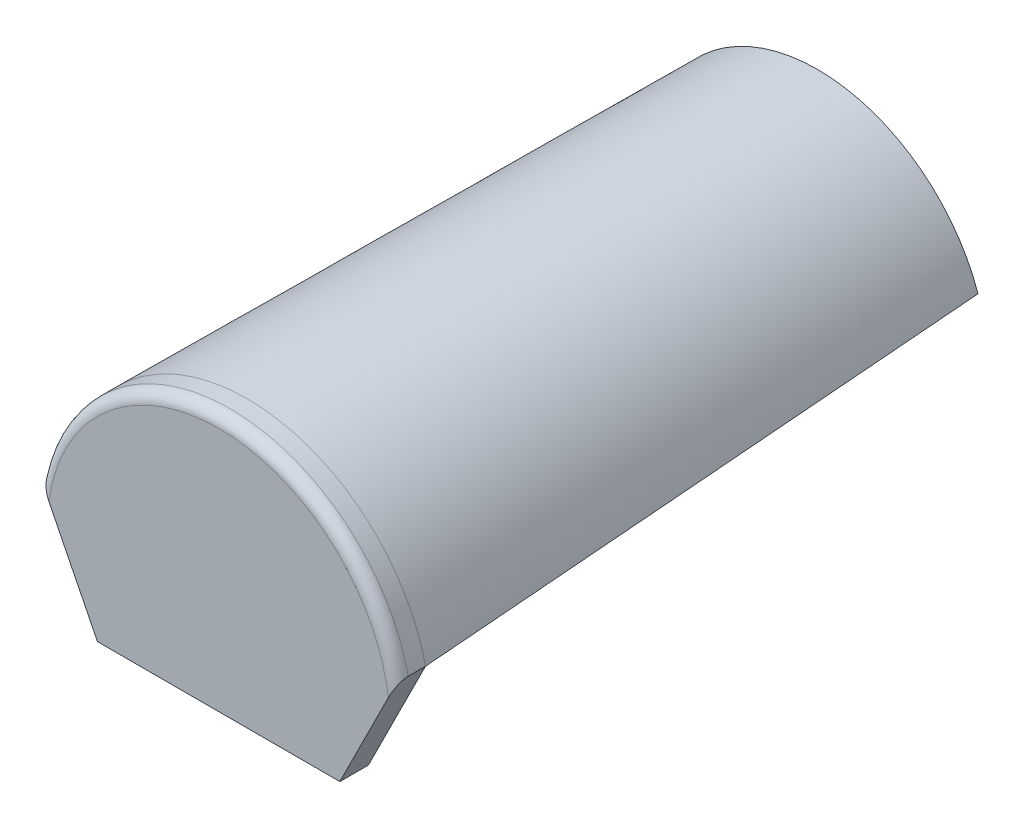
ISO-10303-21;
HEADER;
FILE_DESCRIPTION(('STEP AP214'),'2;1');
FILE_NAME('part.step','',(''),(''),'','','');
FILE_SCHEMA(('AUTOMOTIVE_DESIGN { 1 0 10303 214 1 1 1 1 }'));
ENDSEC;
DATA;
#1=APPLICATION_CONTEXT('core data for automotive mechanical design processes');
#2=APPLICATION_PROTOCOL_DEFINITION('international standard','automotive_design',2000,#1);
#3=PRODUCT_CONTEXT('',#1,'mechanical');
#4=PRODUCT('Part','Part','',(#3));
#5=PRODUCT_RELATED_PRODUCT_CATEGORY('part','',(#4));
#6=PRODUCT_DEFINITION_FORMATION('','',#4);
#7=PRODUCT_DEFINITION_CONTEXT('part definition',#1,'design');
#8=PRODUCT_DEFINITION('design','',#6,#7);
#9=PRODUCT_DEFINITION_SHAPE('','',#8);
#10=(LENGTH_UNIT() NAMED_UNIT(*) SI_UNIT(.MILLI.,.METRE.));
#11=(NAMED_UNIT(*) PLANE_ANGLE_UNIT() SI_UNIT($,.RADIAN.));
#12=(NAMED_UNIT(*) SI_UNIT($,.STERADIAN.) SOLID_ANGLE_UNIT());
#13=UNCERTAINTY_MEASURE_WITH_UNIT(LENGTH_MEASURE(1.E-05),#10,'distance_accuracy_value','');
#14=(GEOMETRIC_REPRESENTATION_CONTEXT(3) GLOBAL_UNCERTAINTY_ASSIGNED_CONTEXT((#13)) GLOBAL_UNIT_ASSIGNED_CONTEXT((#10,
#11,#12)) REPRESENTATION_CONTEXT('',''));
#15=CARTESIAN_POINT('',(0.,0.,0.));
#16=DIRECTION('',(0.,0.,1.));
#17=DIRECTION('',(1.,0.,0.));
#18=AXIS2_PLACEMENT_3D('',#15,#16,#17);
#19=CARTESIAN_POINT('',(125.,-28.125,20.));
#20=DIRECTION('',(0.,0.,-1.));
#21=DIRECTION('',(-1.,0.,0.));
#22=AXIS2_PLACEMENT_3D('',#19,#20,#21);
#23=CYLINDRICAL_SURFACE('',#22,128.125);
#24=DIRECTION('',(0.,0.,-1.));
#25=VECTOR('',#24,1.);
#26=CARTESIAN_POINT('',(0.,0.,20.));
#27=LINE('',#26,#25);
#28=CARTESIAN_POINT('',(0.,0.,12.));
#29=VERTEX_POINT('',#28);
#30=CARTESIAN_POINT('',(0.,0.,0.));
#31=VERTEX_POINT('',#30);
#32=EDGE_CURVE('E186',#29,#31,#27,.T.);
#33=ORIENTED_EDGE('',*,*,#32,.F.);
#34=CARTESIAN_POINT('',(125.,-28.125,12.));
#35=DIRECTION('',(0.,0.,1.));
#36=DIRECTION('',(1.,0.,0.));
#37=AXIS2_PLACEMENT_3D('',#34,#35,#36);
#38=CIRCLE('',#37,128.125);
#39=CARTESIAN_POINT('',(250.,0.,12.));
#40=VERTEX_POINT('',#39);
#41=EDGE_CURVE('E199',#29,#40,#38,.F.);
#42=ORIENTED_EDGE('',*,*,#41,.T.);
#43=DIRECTION('',(0.,0.,-1.));
#44=VECTOR('',#43,1.);
#45=CARTESIAN_POINT('',(250.,0.,20.));
#46=LINE('',#45,#44);
#47=CARTESIAN_POINT('',(250.,0.,0.));
#48=VERTEX_POINT('',#47);
#49=EDGE_CURVE('E238',#40,#48,#46,.T.);
#50=ORIENTED_EDGE('',*,*,#49,.T.);
#51=CARTESIAN_POINT('',(0.,0.,0.));
#52=CARTESIAN_POINT('',(1.60623277237835,7.13881232168169,0.));
#53=CARTESIAN_POINT('',(6.030879886365,21.0831731477727,0.));
#54=CARTESIAN_POINT('',(16.0473437789444,40.4505164377242,0.));
#55=CARTESIAN_POINT('',(29.1160998191318,57.7720338535226,0.));
#56=CARTESIAN_POINT('',(44.8500876651793,72.6082314918511,0.));
#57=CARTESIAN_POINT('',(62.8084470244667,84.5828128238449,0.));
#58=CARTESIAN_POINT('',(82.5049519033735,93.3866006304086,0.));
#59=CARTESIAN_POINT('',(103.415398608992,98.7826951482014,0.));
#60=CARTESIAN_POINT('',(117.79573479048,100.,0.));
#61=CARTESIAN_POINT('',(132.20426520952,100.,0.));
#62=CARTESIAN_POINT('',(146.584601391007,98.7826951482015,0.));
#63=CARTESIAN_POINT('',(167.495048096627,93.3866006304082,0.));
#64=CARTESIAN_POINT('',(187.191552975533,84.5828128238452,0.));
#65=CARTESIAN_POINT('',(205.149912334821,72.6082314918509,0.));
#66=CARTESIAN_POINT('',(220.883900180868,57.7720338535227,0.));
#67=CARTESIAN_POINT('',(233.952656221055,40.4505164377242,0.));
#68=CARTESIAN_POINT('',(243.969120113636,21.0831731477728,0.));
#69=CARTESIAN_POINT('',(248.393767227622,7.13881232168172,0.));
#70=CARTESIAN_POINT('',(250.,0.,0.));
#71=B_SPLINE_CURVE_WITH_KNOTS('',3,(#51,#52,#53,#54,#55,#56,#57,#58,#59,#60,#61,#62,#63,#64,#65,
#66,#67,#68,#69,#70),.UNSPECIFIED.,.F.,.F.,(4,1,1,1,1,1,1,1,2,1,1,1,1,1,1,1,4),
(0.472541137445926,0.505507316355555,0.538473495265185,0.571439674174815,0.604405853084444,
0.637372031994074,0.670338210903704,0.703304389813333,0.736270568722963,0.769236747632593,
0.802202926542222,0.835169105451852,0.868135284361481,0.901101463271111,0.934067642180741,
0.96703382109037,1.),.UNSPECIFIED.);
#72=EDGE_CURVE('E209',#31,#48,#71,.T.);
#73=ORIENTED_EDGE('',*,*,#72,.F.);
#74=EDGE_LOOP('',(#33,#42,#50,#73));
#75=FACE_BOUND('',#74,.T.);
#76=ADVANCED_FACE('F117',(#75),#23,.T.);
#77=CARTESIAN_POINT('',(116.90186054998,-233.803721099959,20.));
#78=DIRECTION('',(0.894427190999916,0.447213595499958,0.));
#79=DIRECTION('',(-0.447213595499958,0.894427190999916,0.));
#80=AXIS2_PLACEMENT_3D('',#77,#78,#79);
#81=PLANE('',#80);
#82=DIRECTION('',(0.447213595499958,-0.894427190999916,0.));
#83=VECTOR('',#82,1.);
#84=CARTESIAN_POINT('',(116.90186054998,-233.803721099959,20.));
#85=LINE('',#84,#83);
#86=CARTESIAN_POINT('',(5.97026255067591,-11.9405251013519,20.));
#87=VERTEX_POINT('',#86);
#88=CARTESIAN_POINT('',(40.,-80.,20.));
#89=VERTEX_POINT('',#88);
#90=EDGE_CURVE('E300',#87,#89,#85,.T.);
#91=ORIENTED_EDGE('',*,*,#90,.F.);
#92=CARTESIAN_POINT('',(5.9702625506759,-11.9405251013518,20.));
#93=CARTESIAN_POINT('',(5.82595946109599,-11.651918922192,19.9999817795034));
#94=CARTESIAN_POINT('',(5.68164689250519,-11.3632937850104,19.9937967903413));
#95=CARTESIAN_POINT('',(5.39321032370489,-10.7864206474098,19.9685980804405));
#96=CARTESIAN_POINT('',(5.24908638146081,-10.4981727629216,19.9495810645104));
#97=CARTESIAN_POINT('',(4.96056207165153,-9.92112414330308,19.8980893113744));
#98=CARTESIAN_POINT('',(4.81616415267594,-9.6323283053519,19.8655452288795));
#99=CARTESIAN_POINT('',(4.52815016631784,-9.05630033263571,19.7863583983228));
#100=CARTESIAN_POINT('',(4.38453403980707,-8.76906807961413,19.7397167320008));
#101=CARTESIAN_POINT('',(4.09672018392652,-8.19344036785304,19.6309397850744));
#102=CARTESIAN_POINT('',(3.95253576494703,-7.90507152989407,19.5686272740713));
#103=CARTESIAN_POINT('',(3.66575167923147,-7.33150335846298,19.4278795743591));
#104=CARTESIAN_POINT('',(3.52315188948474,-7.04630377896949,19.3494456464607));
#105=CARTESIAN_POINT('',(3.24035701906228,-6.48071403812456,19.1755617639944));
#106=CARTESIAN_POINT('',(3.10015748320891,-6.20031496641781,19.0801482175577));
#107=CARTESIAN_POINT('',(2.82254991417251,-5.64509982834499,18.8709843401185));
#108=CARTESIAN_POINT('',(2.6851409693012,-5.37028193860237,18.7572401099189));
#109=CARTESIAN_POINT('',(2.44253242235396,-4.8850648447079,18.5360728408015));
#110=CARTESIAN_POINT('',(2.33665278874327,-4.67330557748652,18.4323777025299));
#111=CARTESIAN_POINT('',(2.12764032282034,-4.25528064564068,18.2119014321062));
#112=CARTESIAN_POINT('',(2.02450748027537,-4.04901496055075,18.0951203487122));
#113=CARTESIAN_POINT('',(1.8216681005836,-3.6433362011672,17.8476998645153));
#114=CARTESIAN_POINT('',(1.72196001470965,-3.44392002941928,17.7170668399828));
#115=CARTESIAN_POINT('',(1.52670017038173,-3.05340034076344,17.4410306427511));
#116=CARTESIAN_POINT('',(1.43114837663157,-2.86229675326313,17.2956275955173));
#117=CARTESIAN_POINT('',(1.2438214254033,-2.4876428508066,16.9869741326968));
#118=CARTESIAN_POINT('',(1.1521208365485,-2.304241673097,16.8234960897245));
#119=CARTESIAN_POINT('',(0.975222793028402,-1.95044558605679,16.479610359815));
#120=CARTESIAN_POINT('',(0.89002673982682,-1.78005347965362,16.2991990430066));
#121=CARTESIAN_POINT('',(0.727943683597129,-1.45588736719424,15.9215020576505));
#122=CARTESIAN_POINT('',(0.651033177350553,-1.30206635470108,15.7242671252149));
#123=CARTESIAN_POINT('',(0.507121742305845,-1.01424348461166,15.3125296992894));
#124=CARTESIAN_POINT('',(0.440112345019628,-0.880224690039225,15.0980422074217));
#125=CARTESIAN_POINT('',(0.342760607640115,-0.685521215280205,14.7427541016825));
#126=CARTESIAN_POINT('',(0.308545868378507,-0.617091736756991,14.6072150621359));
#127=CARTESIAN_POINT('',(0.244837165192571,-0.489674330385125,14.3307167598522));
#128=CARTESIAN_POINT('',(0.215341721730412,-0.43068344346081,14.1897592131175));
#129=CARTESIAN_POINT('',(0.161579498036405,-0.323158996072802,13.9032229119672));
#130=CARTESIAN_POINT('',(0.137303350913972,-0.274606701827939,13.7576529833679));
#131=CARTESIAN_POINT('',(0.0943500900458207,-0.188700180091644,13.4624883669084));
#132=CARTESIAN_POINT('',(0.0756714313704474,-0.151342862740901,13.3128948020331));
#133=CARTESIAN_POINT('',(0.0402371691266908,-0.0804743382533814,12.9716456326696));
#134=CARTESIAN_POINT('',(0.0252105392535766,-0.0504210785071384,12.7790637388159));
#135=CARTESIAN_POINT('',(0.0101182157460026,-0.0202364314920093,12.4881699163889));
#136=CARTESIAN_POINT('',(0.00632865577995934,-0.0126573115599358,12.3907556570888));
#137=CARTESIAN_POINT('',(0.00126834763367377,-0.00253669526736834,12.1955694053455));
#138=CARTESIAN_POINT('',(-1.5888051430922E-06,3.17761027482905E-06,12.0977973077785));
#139=CARTESIAN_POINT('',(0.,0.,12.));
#140=B_SPLINE_CURVE_WITH_KNOTS('',3,(#92,#93,#94,#95,#96,#97,#98,#99,#100,#101,#102,#103,#104,
#105,#106,#107,#108,#109,#110,#111,#112,#113,#114,#115,#116,#117,#118,#119,#120,#121,#122,#123,
#124,#125,#126,#127,#128,#129,#130,#131,#132,#133,#134,#135,#136,#137,#138,#139),.UNSPECIFIED.,
.F.,.F.,(4,2,2,2,2,2,2,2,2,2,2,2,2,2,2,2,2,2,2,2,2,2,2,4),(0.,0.96798730233927,1.93622327295291,
2.90948526153058,3.88267258843746,4.86740440165289,5.85205923104535,6.83462763420168,
7.81686969256157,8.59191371058613,9.36695484090341,10.141640743515,10.9163200660299,
11.7021988095809,12.4882464030713,13.2720020372362,14.0550833902919,14.5216169500379,
14.9880039598896,15.4535468420195,15.9189611138195,16.5040289226431,16.797235759781,
17.0905370433752),.UNSPECIFIED.);
#141=EDGE_CURVE('E13',#87,#29,#140,.T.);
#142=ORIENTED_EDGE('',*,*,#141,.T.);
#143=ORIENTED_EDGE('',*,*,#32,.T.);
#144=DIRECTION('',(0.447213595499958,-0.894427190999916,0.));
#145=VECTOR('',#144,1.);
#146=CARTESIAN_POINT('',(116.90186054998,-233.803721099959,0.));
#147=LINE('',#146,#145);
#148=CARTESIAN_POINT('',(40.,-80.,0.));
#149=VERTEX_POINT('',#148);
#150=EDGE_CURVE('E191',#31,#149,#147,.T.);
#151=ORIENTED_EDGE('',*,*,#150,.T.);
#152=DIRECTION('',(0.,0.,-1.));
#153=VECTOR('',#152,1.);
#154=CARTESIAN_POINT('',(40.,-80.,20.));
#155=LINE('',#154,#153);
#156=EDGE_CURVE('E200',#89,#149,#155,.T.);
#157=ORIENTED_EDGE('',*,*,#156,.F.);
#158=EDGE_LOOP('',(#91,#142,#143,#151,#157));
#159=FACE_BOUND('',#158,.T.);
#160=ADVANCED_FACE('F188',(#159),#81,.F.);
#161=CARTESIAN_POINT('',(125.,-80.,20.));
#162=DIRECTION('',(0.,1.,0.));
#163=DIRECTION('',(-1.,0.,0.));
#164=AXIS2_PLACEMENT_3D('',#161,#162,#163);
#165=PLANE('',#164);
#166=DIRECTION('',(1.,0.,0.));
#167=VECTOR('',#166,1.);
#168=CARTESIAN_POINT('',(125.,-80.,0.));
#169=LINE('',#168,#167);
#170=CARTESIAN_POINT('',(210.,-80.,0.));
#171=VERTEX_POINT('',#170);
#172=EDGE_CURVE('E234',#149,#171,#169,.T.);
#173=ORIENTED_EDGE('',*,*,#172,.T.);
#174=DIRECTION('',(0.,0.,-1.));
#175=VECTOR('',#174,1.);
#176=CARTESIAN_POINT('',(210.,-80.,20.));
#177=LINE('',#176,#175);
#178=CARTESIAN_POINT('',(210.,-80.,20.));
#179=VERTEX_POINT('',#178);
#180=EDGE_CURVE('E287',#179,#171,#177,.T.);
#181=ORIENTED_EDGE('',*,*,#180,.F.);
#182=DIRECTION('',(1.,0.,0.));
#183=VECTOR('',#182,1.);
#184=CARTESIAN_POINT('',(125.,-80.,20.));
#185=LINE('',#184,#183);
#186=EDGE_CURVE('E296',#89,#179,#185,.T.);
#187=ORIENTED_EDGE('',*,*,#186,.F.);
#188=ORIENTED_EDGE('',*,*,#156,.T.);
#189=EDGE_LOOP('',(#173,#181,#187,#188));
#190=FACE_BOUND('',#189,.T.);
#191=ADVANCED_FACE('F258',(#190),#165,.F.);
#192=CARTESIAN_POINT('',(133.09813945002,-233.803721099959,20.));
#193=DIRECTION('',(-0.894427190999916,0.447213595499958,0.));
#194=DIRECTION('',(-0.447213595499958,-0.894427190999916,0.));
#195=AXIS2_PLACEMENT_3D('',#192,#193,#194);
#196=PLANE('',#195);
#197=ORIENTED_EDGE('',*,*,#49,.F.);
#198=CARTESIAN_POINT('',(250.,0.,12.));
#199=CARTESIAN_POINT('',(250.000001001473,2.00294690712535E-06,12.0838213230434));
#200=CARTESIAN_POINT('',(249.999068437598,-0.00186312480393064,12.1676284210833));
#201=CARTESIAN_POINT('',(249.995348520284,-0.0093029594314035,12.3350310795616));
#202=CARTESIAN_POINT('',(249.992561290855,-0.0148774182894118,12.4186266537681));
#203=CARTESIAN_POINT('',(249.98144544465,-0.0371091107007333,12.6686242278631));
#204=CARTESIAN_POINT('',(249.970362603427,-0.0592747931459309,12.83445314013));
#205=CARTESIAN_POINT('',(249.94127870324,-0.117442593519188,13.161235877582));
#206=CARTESIAN_POINT('',(249.923349594707,-0.153300810586656,13.3222222240009));
#207=CARTESIAN_POINT('',(249.880979923896,-0.238040152208329,13.6398710574306));
#208=CARTESIAN_POINT('',(249.856538125399,-0.286923749201584,13.7965327173051));
#209=CARTESIAN_POINT('',(249.801769840534,-0.39646031893193,14.1038426888789));
#210=CARTESIAN_POINT('',(249.771468387462,-0.457063225075571,14.254513405487));
#211=CARTESIAN_POINT('',(249.70546289714,-0.589074205720376,14.5498487732153));
#212=CARTESIAN_POINT('',(249.66975666486,-0.66048667028031,14.6945109535443));
#213=CARTESIAN_POINT('',(249.555224413801,-0.889551172398159,15.1192452622234));
#214=CARTESIAN_POINT('',(249.469083696962,-1.06183260607521,15.3895279729615));
#215=CARTESIAN_POINT('',(249.236331569423,-1.5273368611538,16.0259714175674));
#216=CARTESIAN_POINT('',(249.080606676542,-1.83878664691653,16.3754004686895));
#217=CARTESIAN_POINT('',(248.830389848284,-2.33922030343266,16.8548583971933));
#218=CARTESIAN_POINT('',(248.744095746035,-2.51180850792966,17.0073907708141));
#219=CARTESIAN_POINT('',(248.566854516747,-2.86629096650621,17.2983725080864));
#220=CARTESIAN_POINT('',(248.475907472064,-3.0481850558711,17.436822120874));
#221=CARTESIAN_POINT('',(248.23857957924,-3.52284084152062,17.7736134472089));
#222=CARTESIAN_POINT('',(248.089498921358,-3.82100215728351,17.9624422794156));
#223=CARTESIAN_POINT('',(247.784562532253,-4.43087493549344,18.3105085483479));
#224=CARTESIAN_POINT('',(247.628702926174,-4.7425941476518,18.4697287790236));
#225=CARTESIAN_POINT('',(247.311430472489,-5.37713905502178,18.7616092213028));
#226=CARTESIAN_POINT('',(247.149998825979,-5.70000234804274,18.8941665411566));
#227=CARTESIAN_POINT('',(246.82351817758,-6.35296364484071,19.13420822846));
#228=CARTESIAN_POINT('',(246.658469838692,-6.68306032261508,19.2416971499995));
#229=CARTESIAN_POINT('',(246.290056916612,-7.4198861667756,19.4541579884725));
#230=CARTESIAN_POINT('',(246.086061527967,-7.82787694406689,19.5536532309992));
#231=CARTESIAN_POINT('',(245.675477315548,-8.64904536890418,19.7214892789746));
#232=CARTESIAN_POINT('',(245.468887423934,-9.06222515213241,19.7898167938281));
#233=CARTESIAN_POINT('',(245.057054471684,-9.88589105663204,19.896793990089));
#234=CARTESIAN_POINT('',(244.851831791093,-10.2963364178141,19.9358377991267));
#235=CARTESIAN_POINT('',(244.543644681936,-10.9127106361288,19.9745338747029));
#236=CARTESIAN_POINT('',(244.440907868982,-11.1181842620369,19.984121122954));
#237=CARTESIAN_POINT('',(244.235361347802,-11.5292773043968,19.99685191086));
#238=CARTESIAN_POINT('',(244.132551645244,-11.7348967095117,19.9999959061294));
#239=CARTESIAN_POINT('',(244.029737449324,-11.9405251013518,20.));
#240=B_SPLINE_CURVE_WITH_KNOTS('',3,(#198,#199,#200,#201,#202,#203,#204,#205,#206,#207,#208,
#209,#210,#211,#212,#213,#214,#215,#216,#217,#218,#219,#220,#221,#222,#223,#224,#225,#226,#227,
#228,#229,#230,#231,#232,#233,#234,#235,#236,#237,#238,#239),.UNSPECIFIED.,.F.,.F.,(4,2,2,2,2,2,
2,2,2,2,2,2,2,2,2,2,2,2,2,2,4),(0.,0.251410052657297,0.502803296863297,1.00494447028012,
1.50194752990346,1.9990449964642,2.49406392254795,2.98928443151722,3.98144821340837,
5.45274772937897,6.19022159830809,6.9276824184224,8.07527437152833,9.22353113950089,
10.3761374112834,11.5285341296516,12.9279109625886,14.3278839636079,15.7086589212987,
16.3983621964917,17.0880166997798),.UNSPECIFIED.);
#241=CARTESIAN_POINT('',(244.029737449324,-11.9405251013518,20.));
#242=VERTEX_POINT('',#241);
#243=EDGE_CURVE('E145',#40,#242,#240,.T.);
#244=ORIENTED_EDGE('',*,*,#243,.T.);
#245=DIRECTION('',(0.447213595499958,0.894427190999916,0.));
#246=VECTOR('',#245,1.);
#247=CARTESIAN_POINT('',(133.09813945002,-233.803721099959,20.));
#248=LINE('',#247,#246);
#249=EDGE_CURVE('E293',#179,#242,#248,.T.);
#250=ORIENTED_EDGE('',*,*,#249,.F.);
#251=ORIENTED_EDGE('',*,*,#180,.T.);
#252=DIRECTION('',(0.447213595499958,0.894427190999916,0.));
#253=VECTOR('',#252,1.);
#254=CARTESIAN_POINT('',(133.09813945002,-233.803721099959,0.));
#255=LINE('',#254,#253);
#256=EDGE_CURVE('E304',#171,#48,#255,.T.);
#257=ORIENTED_EDGE('',*,*,#256,.T.);
#258=EDGE_LOOP('',(#197,#244,#250,#251,#257));
#259=FACE_BOUND('',#258,.T.);
#260=ADVANCED_FACE('F261',(#259),#196,.F.);
#261=CARTESIAN_POINT('',(125.,-229.754651374949,20.));
#262=DIRECTION('',(0.,0.,1.));
#263=DIRECTION('',(1.,0.,0.));
#264=AXIS2_PLACEMENT_3D('',#261,#262,#263);
#265=PLANE('',#264);
#266=ORIENTED_EDGE('',*,*,#249,.T.);
#267=CARTESIAN_POINT('',(125.,-28.125,20.));
#268=DIRECTION('',(0.,0.,1.));
#269=DIRECTION('',(1.,0.,0.));
#270=AXIS2_PLACEMENT_3D('',#267,#268,#269);
#271=CIRCLE('',#270,120.125);
#272=EDGE_CURVE('E131',#242,#87,#271,.T.);
#273=ORIENTED_EDGE('',*,*,#272,.T.);
#274=ORIENTED_EDGE('',*,*,#90,.T.);
#275=ORIENTED_EDGE('',*,*,#186,.T.);
#276=EDGE_LOOP('',(#266,#273,#274,#275));
#277=FACE_BOUND('',#276,.T.);
#278=ADVANCED_FACE('F266',(#277),#265,.T.);
#279=CARTESIAN_POINT('',(125.,-229.754651374949,0.));
#280=DIRECTION('',(0.,0.,1.));
#281=DIRECTION('',(1.,0.,0.));
#282=AXIS2_PLACEMENT_3D('',#279,#280,#281);
#283=PLANE('',#282);
#284=ORIENTED_EDGE('',*,*,#150,.F.);
#285=DIRECTION('',(-1.,0.,0.));
#286=VECTOR('',#285,1.);
#287=CARTESIAN_POINT('',(0.,0.,0.));
#288=LINE('',#287,#286);
#289=CARTESIAN_POINT('',(20.,0.,0.));
#290=VERTEX_POINT('',#289);
#291=EDGE_CURVE('E223',#290,#31,#288,.T.);
#292=ORIENTED_EDGE('',*,*,#291,.F.);
#293=CARTESIAN_POINT('',(230.,0.,0.));
#294=CARTESIAN_POINT('',(229.493757838214,1.47654547475234,0.));
#295=CARTESIAN_POINT('',(228.956312640864,2.94238689454324,0.));
#296=CARTESIAN_POINT('',(227.820140072926,5.85005639712402,0.));
#297=CARTESIAN_POINT('',(227.221415191567,7.29188545255088,0.));
#298=CARTESIAN_POINT('',(225.963781400808,10.149010022975,0.));
#299=CARTESIAN_POINT('',(225.304873978876,11.564306192716,0.));
#300=CARTESIAN_POINT('',(223.927934449459,14.365828835031,0.));
#301=CARTESIAN_POINT('',(223.209902765419,15.7520555157103,0.));
#302=CARTESIAN_POINT('',(221.716449277304,18.4919917988752,0.));
#303=CARTESIAN_POINT('',(220.94106767989,19.8457233173696,0.));
#304=CARTESIAN_POINT('',(219.334006411574,22.5193289499796,0.));
#305=CARTESIAN_POINT('',(218.502327136566,23.8392033020934,0.));
#306=CARTESIAN_POINT('',(216.78414180656,26.4427696025431,0.));
#307=CARTESIAN_POINT('',(215.897636105421,27.726461784327,0.));
#308=CARTESIAN_POINT('',(214.071266852771,30.255269435823,0.));
#309=CARTESIAN_POINT('',(213.131403427182,31.500384996564,0.));
#310=CARTESIAN_POINT('',(210.877523922873,34.3588873344611,0.));
#311=CARTESIAN_POINT('',(209.543354489356,35.9564382979323,0.));
#312=CARTESIAN_POINT('',(206.787394393498,39.0742029001996,0.));
#313=CARTESIAN_POINT('',(205.365602523367,40.5944154724334,0.));
#314=CARTESIAN_POINT('',(203.170621810634,42.8127956414497,0.));
#315=CARTESIAN_POINT('',(202.428541088132,43.5419671965333,0.));
#316=CARTESIAN_POINT('',(200.924148636055,44.9791314761506,0.));
#317=CARTESIAN_POINT('',(200.16183688367,45.6871241768048,0.));
#318=CARTESIAN_POINT('',(197.845843422212,47.7782417466334,0.));
#319=CARTESIAN_POINT('',(196.262663701568,49.1289504716601,0.));
#320=CARTESIAN_POINT('',(193.023092075443,51.7392889909391,0.));
#321=CARTESIAN_POINT('',(191.366700301622,52.9989189489716,0.));
#322=CARTESIAN_POINT('',(187.985566669476,55.4229989395715,0.));
#323=CARTESIAN_POINT('',(186.260824984441,56.5874492134284,0.));
#324=CARTESIAN_POINT('',(183.187741011401,58.5388949252356,0.));
#325=CARTESIAN_POINT('',(181.853052513373,59.3474939256303,0.));
#326=CARTESIAN_POINT('',(179.15070407035,60.9078396854721,0.));
#327=CARTESIAN_POINT('',(177.783042161544,61.659583047662,0.));
#328=CARTESIAN_POINT('',(175.017215890588,63.1046568622013,0.));
#329=CARTESIAN_POINT('',(173.619052163934,63.7979885300811,0.));
#330=CARTESIAN_POINT('',(170.794833750715,65.1250129631622,0.));
#331=CARTESIAN_POINT('',(169.368779446502,65.7587065452502,0.));
#332=CARTESIAN_POINT('',(165.052152312534,67.5689997009705,0.));
#333=CARTESIAN_POINT('',(162.122945157575,68.6549004994592,0.));
#334=CARTESIAN_POINT('',(156.183335518506,70.5756148503203,0.));
#335=CARTESIAN_POINT('',(153.172933064523,71.4104284958518,0.));
#336=CARTESIAN_POINT('',(148.61340291116,72.4704035871659,0.));
#337=CARTESIAN_POINT('',(147.086060670557,72.7917135556641,0.));
#338=CARTESIAN_POINT('',(144.019090109052,73.3696593679455,0.));
#339=CARTESIAN_POINT('',(142.47946181571,73.626295356765,0.));
#340=CARTESIAN_POINT('',(139.390767851403,74.0743141994568,0.));
#341=CARTESIAN_POINT('',(137.841702182206,74.2656970655696,0.));
#342=CARTESIAN_POINT('',(134.736876034357,74.5830435914031,0.));
#343=CARTESIAN_POINT('',(133.181115541554,74.7090071127857,0.));
#344=CARTESIAN_POINT('',(130.065766117343,74.8952929972664,0.));
#345=CARTESIAN_POINT('',(128.506177428098,74.9556194103652,0.));
#346=CARTESIAN_POINT('',(125.385844539654,75.0103863393465,0.));
#347=CARTESIAN_POINT('',(123.825100342424,75.0048269673136,0.));
#348=CARTESIAN_POINT('',(120.70523885278,74.9278649112359,0.));
#349=CARTESIAN_POINT('',(119.146121559514,74.8564622616744,0.));
#350=CARTESIAN_POINT('',(116.032276053873,74.6480661299266,0.));
#351=CARTESIAN_POINT('',(114.477547846319,74.5110725757282,0.));
#352=CARTESIAN_POINT('',(111.375191682378,74.1716983498655,0.));
#353=CARTESIAN_POINT('',(109.827563955038,73.9693155837134,0.));
#354=CARTESIAN_POINT('',(106.742238310111,73.499361420042,0.));
#355=CARTESIAN_POINT('',(105.204540388591,73.2317900483429,0.));
#356=CARTESIAN_POINT('',(102.14179177844,72.6320704384075,0.));
#357=CARTESIAN_POINT('',(100.616741089361,72.2999222024608,0.));
#358=CARTESIAN_POINT('',(97.5819791624299,71.5717014719597,0.));
#359=CARTESIAN_POINT('',(96.0722679194729,71.1756289986803,0.));
#360=CARTESIAN_POINT('',(93.0709173502633,70.3201835168676,0.));
#361=CARTESIAN_POINT('',(91.5792776664869,69.8608117628656,0.));
#362=CARTESIAN_POINT('',(88.6167270693166,68.8794864672291,0.));
#363=CARTESIAN_POINT('',(87.1458161784017,68.3575328577345,0.));
#364=CARTESIAN_POINT('',(84.2272910819668,67.2521323616012,0.));
#365=CARTESIAN_POINT('',(82.7796768258513,66.6686856085339,0.));
#366=CARTESIAN_POINT('',(79.9103048869851,65.4413461874465,0.));
#367=CARTESIAN_POINT('',(78.4885471534616,64.7974536381356,0.));
#368=CARTESIAN_POINT('',(75.6737590149572,63.4503676567969,0.));
#369=CARTESIAN_POINT('',(74.280722874808,62.7471862092183,0.));
#370=CARTESIAN_POINT('',(71.5255523559492,61.2826805972126,0.));
#371=CARTESIAN_POINT('',(70.1634180774243,60.5213562443194,0.));
#372=CARTESIAN_POINT('',(67.4724005030517,58.9420274058906,0.));
#373=CARTESIAN_POINT('',(66.1435174894825,58.1240224394008,0.));
#374=CARTESIAN_POINT('',(63.5213933878022,56.4327689563427,0.));
#375=CARTESIAN_POINT('',(62.2281520566446,55.5595208166203,0.));
#376=CARTESIAN_POINT('',(59.6793335520147,53.7589360260302,0.));
#377=CARTESIAN_POINT('',(58.4237672253765,52.8315840203919,0.));
#378=CARTESIAN_POINT('',(55.95284481286,50.924773992494,0.));
#379=CARTESIAN_POINT('',(54.7374888398929,49.9453158239395,0.));
#380=CARTESIAN_POINT('',(52.3490937489951,47.9360788849059,0.));
#381=CARTESIAN_POINT('',(51.1760547257192,46.9063000018811,0.));
#382=CARTESIAN_POINT('',(48.8745378041998,44.7982821774212,0.));
#383=CARTESIAN_POINT('',(47.7460570166704,43.7200463877991,0.));
#384=CARTESIAN_POINT('',(45.1666141183862,41.1490615817729,0.));
#385=CARTESIAN_POINT('',(43.7337516519438,39.6380918418431,0.));
#386=CARTESIAN_POINT('',(40.9550571490787,36.5379684417475,0.));
#387=CARTESIAN_POINT('',(39.6092283632895,34.9488118652688,0.));
#388=CARTESIAN_POINT('',(37.6591209539044,32.5103038170306,0.));
#389=CARTESIAN_POINT('',(37.0204576161293,31.6882450002377,0.));
#390=CARTESIAN_POINT('',(35.7665470930689,30.0264597752804,0.));
#391=CARTESIAN_POINT('',(35.1512998493489,29.1867334112134,0.));
#392=CARTESIAN_POINT('',(33.342895721476,26.6442103392481,0.));
#393=CARTESIAN_POINT('',(32.1853444313401,24.9159034072793,0.));
#394=CARTESIAN_POINT('',(29.9691605659769,21.3972920847874,0.));
#395=CARTESIAN_POINT('',(28.9105153989375,19.6069956260823,0.));
#396=CARTESIAN_POINT('',(27.3995834353973,16.8796755474551,0.));
#397=CARTESIAN_POINT('',(26.9088619731752,15.9637620360697,0.));
#398=CARTESIAN_POINT('',(25.9533834051799,14.1185058216853,0.));
#399=CARTESIAN_POINT('',(25.4886253010621,13.1891636367783,0.));
#400=CARTESIAN_POINT('',(24.5563428481496,11.2576400631495,0.));
#401=CARTESIAN_POINT('',(24.0905618766031,10.2546172313681,0.));
#402=CARTESIAN_POINT('',(23.1892498532999,8.23533865210655,0.));
#403=CARTESIAN_POINT('',(22.7537121024386,7.2190858947616,0.));
#404=CARTESIAN_POINT('',(21.9138929111055,5.17581524730379,0.));
#405=CARTESIAN_POINT('',(21.5095583512988,4.14881919033308,0.));
#406=CARTESIAN_POINT('',(20.7316101654974,2.08300100412121,0.));
#407=CARTESIAN_POINT('',(20.3580032634655,1.04417634281058,0.));
#408=CARTESIAN_POINT('',(20.,0.,0.));
#409=B_SPLINE_CURVE_WITH_KNOTS('',3,(#293,#294,#295,#296,#297,#298,#299,#300,#301,#302,#303,
#304,#305,#306,#307,#308,#309,#310,#311,#312,#313,#314,#315,#316,#317,#318,#319,#320,#321,#322,
#323,#324,#325,#326,#327,#328,#329,#330,#331,#332,#333,#334,#335,#336,#337,#338,#339,#340,#341,
#342,#343,#344,#345,#346,#347,#348,#349,#350,#351,#352,#353,#354,#355,#356,#357,#358,#359,#360,
#361,#362,#363,#364,#365,#366,#367,#368,#369,#370,#371,#372,#373,#374,#375,#376,#377,#378,#379,
#380,#381,#382,#383,#384,#385,#386,#387,#388,#389,#390,#391,#392,#393,#394,#395,#396,#397,#398,
#399,#400,#401,#402,#403,#404,#405,#406,#407,#408),.UNSPECIFIED.,.F.,.F.,(4,2,2,2,2,2,2,2,2,2,2,
2,2,2,2,2,2,2,2,2,2,2,2,2,2,2,2,2,2,2,2,2,2,2,2,2,2,2,2,2,2,2,2,2,2,2,2,2,2,2,2,2,2,2,2,2,2,4),
(0.,4.68240063872799,9.36461115009321,14.0467059675106,18.7287672548683,23.407576618465,
28.0863530834323,32.7650993539163,37.4438345831435,43.6846441719116,49.925539803445,
53.0462970626784,56.1670578404881,62.4067063875043,68.6463437139378,74.8859652218082,
79.5662299762289,84.2467741668251,88.927220932587,93.6076035790734,102.967795034303,
112.327983016681,117.009151419816,121.690309324988,126.371466352044,131.052633277997,
135.733511345938,140.414381450791,145.095249104183,149.776121896694,154.457144637532,
159.138165524305,163.819186245117,168.50020540801,173.181131810917,177.862063289595,
182.542984600866,187.223896719494,191.903864913038,196.583848277013,201.263871357085,
205.943862515426,210.625188385974,215.306527400645,219.987876885922,224.668922318688,
230.912564018693,237.15643877886,240.279066863576,243.401687155285,249.638619227545,
255.874756186237,258.991677613465,262.108479106033,265.425675024851,268.742133799866,
272.052816139019,275.364221019513),.UNSPECIFIED.);
#410=CARTESIAN_POINT('',(230.,0.,0.));
#411=VERTEX_POINT('',#410);
#412=EDGE_CURVE('E229',#411,#290,#409,.T.);
#413=ORIENTED_EDGE('',*,*,#412,.F.);
#414=DIRECTION('',(-1.,0.,0.));
#415=VECTOR('',#414,1.);
#416=CARTESIAN_POINT('',(250.,0.,0.));
#417=LINE('',#416,#415);
#418=EDGE_CURVE('E318',#48,#411,#417,.T.);
#419=ORIENTED_EDGE('',*,*,#418,.F.);
#420=ORIENTED_EDGE('',*,*,#256,.F.);
#421=ORIENTED_EDGE('',*,*,#172,.F.);
#422=EDGE_LOOP('',(#284,#292,#413,#419,#420,#421));
#423=FACE_BOUND('',#422,.T.);
#424=ADVANCED_FACE('F232',(#423),#283,.F.);
#425=CARTESIAN_POINT('',(125.,-19.1015624999999,-400.));
#426=DIRECTION('',(0.,0.,1.));
#427=DIRECTION('',(1.,0.,0.));
#428=AXIS2_PLACEMENT_3D('',#425,#426,#427);
#429=PLANE('',#428);
#430=CARTESIAN_POINT('',(125.,-19.1015624999999,-400.));
#431=DIRECTION('',(0.,0.,1.));
#432=DIRECTION('',(1.,0.,0.));
#433=AXIS2_PLACEMENT_3D('',#430,#431,#432);
#434=CIRCLE('',#433,119.1015625);
#435=CARTESIAN_POINT('',(237.5,20.0000000000001,-400.));
#436=VERTEX_POINT('',#435);
#437=CARTESIAN_POINT('',(12.5,20.,-400.));
#438=VERTEX_POINT('',#437);
#439=EDGE_CURVE('E213',#436,#438,#434,.T.);
#440=ORIENTED_EDGE('',*,*,#439,.F.);
#441=DIRECTION('',(1.,0.,0.));
#442=VECTOR('',#441,1.);
#443=CARTESIAN_POINT('',(237.5,20.0000000000001,-400.));
#444=LINE('',#443,#442);
#445=CARTESIAN_POINT('',(225.5,20.,-400.));
#446=VERTEX_POINT('',#445);
#447=EDGE_CURVE('E334',#446,#436,#444,.T.);
#448=ORIENTED_EDGE('',*,*,#447,.F.);
#449=CARTESIAN_POINT('',(125.,-51.1177884615383,-400.));
#450=DIRECTION('',(0.,0.,-1.));
#451=DIRECTION('',(1.,0.,0.));
#452=AXIS2_PLACEMENT_3D('',#449,#450,#451);
#453=CIRCLE('',#452,123.117788461538);
#454=CARTESIAN_POINT('',(24.5,20.,-400.));
#455=VERTEX_POINT('',#454);
#456=EDGE_CURVE('E339',#455,#446,#453,.T.);
#457=ORIENTED_EDGE('',*,*,#456,.F.);
#458=DIRECTION('',(1.,0.,0.));
#459=VECTOR('',#458,1.);
#460=CARTESIAN_POINT('',(24.5,20.,-400.));
#461=LINE('',#460,#459);
#462=EDGE_CURVE('E344',#438,#455,#461,.T.);
#463=ORIENTED_EDGE('',*,*,#462,.F.);
#464=EDGE_LOOP('',(#440,#448,#457,#463));
#465=FACE_BOUND('',#464,.T.);
#466=ADVANCED_FACE('F364',(#465),#429,.F.);
#467=CARTESIAN_POINT('',(0.,0.,0.));
#468=CARTESIAN_POINT('',(4.16666666666665,6.66666666666669,-133.333333333333));
#469=CARTESIAN_POINT('',(8.33333333333332,13.3333333333334,-266.666666666667));
#470=CARTESIAN_POINT('',(12.5,20.,-400.));
#471=CARTESIAN_POINT('',(1.60623277237835,7.13881232168169,0.));
#472=CARTESIAN_POINT('',(5.89853262599266,13.3277800158788,-133.333333333333));
#473=CARTESIAN_POINT('',(10.190832479607,19.5167477100759,-266.666666666667));
#474=CARTESIAN_POINT('',(14.4831323332213,25.705715404273,-400.));
#475=CARTESIAN_POINT('',(6.030879886365,21.0831731477727,0.));
#476=CARTESIAN_POINT('',(10.4654577611596,26.3416190344335,-133.333333333334));
#477=CARTESIAN_POINT('',(14.9000356359541,31.6000649210943,-266.666666666667));
#478=CARTESIAN_POINT('',(19.3346135107487,36.8585108077552,-400.000000000001));
#479=CARTESIAN_POINT('',(16.0473437789444,40.4505164377242,0.));
#480=CARTESIAN_POINT('',(20.412534330092,44.4264177049132,-133.333333333333));
#481=CARTESIAN_POINT('',(24.7777248812397,48.4023189721023,-266.666666666666));
#482=CARTESIAN_POINT('',(29.1429154323873,52.3782202392913,-399.999999999999));
#483=CARTESIAN_POINT('',(29.1160998191318,57.7720338535226,0.));
#484=CARTESIAN_POINT('',(33.1697801929732,60.6068062886665,-133.333333333333));
#485=CARTESIAN_POINT('',(37.2234605668146,63.4415787238105,-266.666666666666));
#486=CARTESIAN_POINT('',(41.277140940656,66.2763511589544,-399.999999999999));
#487=CARTESIAN_POINT('',(44.8500876651793,72.6082314918511,0.));
#488=CARTESIAN_POINT('',(48.3862108997761,74.465139378365,-133.333333333333));
#489=CARTESIAN_POINT('',(51.922334134373,76.3220472648787,-266.666666666667));
#490=CARTESIAN_POINT('',(55.4584573689699,78.1789551513926,-400.));
#491=CARTESIAN_POINT('',(62.8084470244667,84.5828128238449,0.));
#492=CARTESIAN_POINT('',(65.6527082690492,85.6436930775151,-133.333333333333));
#493=CARTESIAN_POINT('',(68.4969695136316,86.7045733311854,-266.666666666667));
#494=CARTESIAN_POINT('',(71.3412307582141,87.7654535848556,-400.));
#495=CARTESIAN_POINT('',(82.5049519033735,93.3866006304086,0.));
#496=CARTESIAN_POINT('',(84.5117258274642,93.8515624667151,-133.333333333333));
#497=CARTESIAN_POINT('',(86.5184997515549,94.3165243030217,-266.666666666667));
#498=CARTESIAN_POINT('',(88.5252736756456,94.7814861393283,-400.));
#499=CARTESIAN_POINT('',(103.415398608992,98.7826951482014,0.));
#500=CARTESIAN_POINT('',(104.467028148159,98.871713835589,-133.333333333333));
#501=CARTESIAN_POINT('',(105.518657687325,98.9607325229766,-266.666666666667));
#502=CARTESIAN_POINT('',(106.570287226491,99.0497512103642,-400.));
#503=CARTESIAN_POINT('',(117.79573479048,100.,0.));
#504=CARTESIAN_POINT('',(118.152102568029,100.,-133.333333333333));
#505=CARTESIAN_POINT('',(118.508470345578,100.,-266.666666666667));
#506=CARTESIAN_POINT('',(118.864838123127,100.,-400.));
#507=CARTESIAN_POINT('',(132.20426520952,100.,0.));
#508=CARTESIAN_POINT('',(131.847897431971,100.,-133.333333333333));
#509=CARTESIAN_POINT('',(131.491529654422,100.,-266.666666666667));
#510=CARTESIAN_POINT('',(131.135161876873,100.,-400.));
#511=CARTESIAN_POINT('',(146.584601391007,98.7826951482015,0.));
#512=CARTESIAN_POINT('',(145.532971851841,98.871713835589,-133.333333333333));
#513=CARTESIAN_POINT('',(144.481342312675,98.9607325229765,-266.666666666666));
#514=CARTESIAN_POINT('',(143.429712773509,99.0497512103641,-399.999999999999));
#515=CARTESIAN_POINT('',(167.495048096627,93.3866006304082,0.));
#516=CARTESIAN_POINT('',(165.488274172536,93.851562466715,-133.333333333334));
#517=CARTESIAN_POINT('',(163.481500248445,94.3165243030217,-266.666666666667));
#518=CARTESIAN_POINT('',(161.474726324354,94.7814861393285,-400.000000000001));
#519=CARTESIAN_POINT('',(187.191552975533,84.5828128238452,0.));
#520=CARTESIAN_POINT('',(184.347291730951,85.6436930775153,-133.333333333333));
#521=CARTESIAN_POINT('',(181.503030486368,86.7045733311854,-266.666666666666));
#522=CARTESIAN_POINT('',(178.658769241786,87.7654535848555,-399.999999999999));
#523=CARTESIAN_POINT('',(205.149912334821,72.6082314918509,0.));
#524=CARTESIAN_POINT('',(201.613789100224,74.4651393783648,-133.333333333333));
#525=CARTESIAN_POINT('',(198.077665865627,76.3220472648786,-266.666666666667));
#526=CARTESIAN_POINT('',(194.54154263103,78.1789551513925,-400.));
#527=CARTESIAN_POINT('',(220.883900180868,57.7720338535227,0.));
#528=CARTESIAN_POINT('',(216.830219807027,60.6068062886667,-133.333333333333));
#529=CARTESIAN_POINT('',(212.776539433186,63.4415787238107,-266.666666666667));
#530=CARTESIAN_POINT('',(208.722859059344,66.2763511589547,-400.));
#531=CARTESIAN_POINT('',(233.952656221055,40.4505164377242,0.));
#532=CARTESIAN_POINT('',(229.587465669907,44.4264177049132,-133.333333333333));
#533=CARTESIAN_POINT('',(225.22227511876,48.4023189721022,-266.666666666667));
#534=CARTESIAN_POINT('',(220.857084567612,52.3782202392912,-400.));
#535=CARTESIAN_POINT('',(243.969120113636,21.0831731477728,0.));
#536=CARTESIAN_POINT('',(239.534542238841,26.3416190344337,-133.333333333333));
#537=CARTESIAN_POINT('',(235.099964364046,31.6000649210946,-266.666666666667));
#538=CARTESIAN_POINT('',(230.665386489251,36.8585108077554,-400.));
#539=CARTESIAN_POINT('',(248.393767227622,7.13881232168172,0.));
#540=CARTESIAN_POINT('',(244.101467374007,13.3277800158788,-133.333333333333));
#541=CARTESIAN_POINT('',(239.809167520393,19.516747710076,-266.666666666667));
#542=CARTESIAN_POINT('',(235.516867666779,25.7057154042731,-400.));
#543=CARTESIAN_POINT('',(250.,0.,0.));
#544=CARTESIAN_POINT('',(245.833333333333,6.66666666666671,-133.333333333333));
#545=CARTESIAN_POINT('',(241.666666666667,13.3333333333334,-266.666666666667));
#546=CARTESIAN_POINT('',(237.5,20.0000000000001,-400.));
#547=B_SPLINE_SURFACE_WITH_KNOTS('',3,3,((#467,#468,#469,#470),(#471,#472,#473,#474),(#475,#476,
#477,#478),(#479,#480,#481,#482),(#483,#484,#485,#486),(#487,#488,#489,#490),(#491,#492,#493,
#494),(#495,#496,#497,#498),(#499,#500,#501,#502),(#503,#504,#505,#506),(#507,#508,#509,#510),
(#511,#512,#513,#514),(#515,#516,#517,#518),(#519,#520,#521,#522),(#523,#524,#525,#526),(#527,
#528,#529,#530),(#531,#532,#533,#534),(#535,#536,#537,#538),(#539,#540,#541,#542),(#543,#544,
#545,#546)),.UNSPECIFIED.,.F.,.F.,.F.,(4,1,1,1,1,1,1,1,2,1,1,1,1,1,1,1,4),(4,4),
(0.472541137445926,0.505507316355555,0.538473495265185,0.571439674174815,0.604405853084444,
0.637372031994074,0.670338210903704,0.703304389813333,0.736270568722963,0.769236747632593,
0.802202926542222,0.835169105451852,0.868135284361481,0.901101463271111,0.934067642180741,
0.96703382109037,1.),(0.,1.),.UNSPECIFIED.);
#548=CARTESIAN_POINT('',(250.,0.,0.));
#549=CARTESIAN_POINT('',(245.833333333333,6.66666666666671,-133.333333333333));
#550=CARTESIAN_POINT('',(241.666666666667,13.3333333333334,-266.666666666667));
#551=CARTESIAN_POINT('',(237.5,20.0000000000001,-400.));
#552=B_SPLINE_CURVE_WITH_KNOTS('',3,(#548,#549,#550,#551),.UNSPECIFIED.,.F.,.F.,(4,4),(0.,1.),.UNSPECIFIED.);
#553=EDGE_CURVE('E218',#48,#436,#552,.T.);
#554=CARTESIAN_POINT('',(0.,0.,0.));
#555=CARTESIAN_POINT('',(4.16666666666665,6.66666666666669,-133.333333333333));
#556=CARTESIAN_POINT('',(8.33333333333332,13.3333333333334,-266.666666666667));
#557=CARTESIAN_POINT('',(12.5,20.,-400.));
#558=B_SPLINE_CURVE_WITH_KNOTS('',3,(#554,#555,#556,#557),.UNSPECIFIED.,.F.,.F.,(4,4),(0.,1.),.UNSPECIFIED.);
#559=EDGE_CURVE('E206',#31,#438,#558,.T.);
#560=ORIENTED_EDGE('',*,*,#72,.T.);
#561=ORIENTED_EDGE('',*,*,#553,.T.);
#562=ORIENTED_EDGE('',*,*,#439,.T.);
#563=ORIENTED_EDGE('',*,*,#559,.F.);
#564=EDGE_LOOP('',(#560,#561,#562,#563));
#565=FACE_BOUND('',#564,.T.);
#566=ADVANCED_FACE('F208',(#565),#547,.T.);
#567=CARTESIAN_POINT('',(20.,0.,0.));
#568=DIRECTION('',(0.,-0.998752338877845,-0.0499376169438923));
#569=DIRECTION('',(-1.,0.,0.));
#570=AXIS2_PLACEMENT_3D('',#567,#568,#569);
#571=PLANE('',#570);
#572=ORIENTED_EDGE('',*,*,#291,.T.);
#573=ORIENTED_EDGE('',*,*,#559,.T.);
#574=ORIENTED_EDGE('',*,*,#462,.T.);
#575=CARTESIAN_POINT('',(20.,0.,0.));
#576=CARTESIAN_POINT('',(21.5,6.66666666666667,-133.333333333333));
#577=CARTESIAN_POINT('',(23.,13.3333333333333,-266.666666666667));
#578=CARTESIAN_POINT('',(24.5,20.,-400.));
#579=B_SPLINE_CURVE_WITH_KNOTS('',3,(#575,#576,#577,#578),.UNSPECIFIED.,.F.,.F.,(4,4),(0.,1.),.UNSPECIFIED.);
#580=EDGE_CURVE('E219',#290,#455,#579,.T.);
#581=ORIENTED_EDGE('',*,*,#580,.F.);
#582=EDGE_LOOP('',(#572,#573,#574,#581));
#583=FACE_BOUND('',#582,.T.);
#584=ADVANCED_FACE('F224',(#583),#571,.T.);
#585=CARTESIAN_POINT('',(230.,0.,0.));
#586=CARTESIAN_POINT('',(228.5,6.66666666666667,-133.333333333333));
#587=CARTESIAN_POINT('',(227.,13.3333333333333,-266.666666666667));
#588=CARTESIAN_POINT('',(225.5,20.,-400.));
#589=CARTESIAN_POINT('',(228.139251555839,5.42718296213615,0.));
#590=CARTESIAN_POINT('',(226.316240688476,11.6177556402596,-133.333333333333));
#591=CARTESIAN_POINT('',(224.493229821113,17.8083283183832,-266.666666666667));
#592=CARTESIAN_POINT('',(222.670218953749,23.9989009965067,-400.));
#593=CARTESIAN_POINT('',(223.574690060912,15.992433193137,0.));
#594=CARTESIAN_POINT('',(221.226880003245,21.2140640425653,-133.333333333333));
#595=CARTESIAN_POINT('',(218.879069945578,26.4356948919935,-266.666666666667));
#596=CARTESIAN_POINT('',(216.531259887911,31.6573257414218,-400.));
#597=CARTESIAN_POINT('',(214.362073210188,30.5926351511626,0.));
#598=CARTESIAN_POINT('',(211.583017661569,34.3854340181828,-133.333333333333));
#599=CARTESIAN_POINT('',(208.803962112951,38.178232885203,-266.666666666667));
#600=CARTESIAN_POINT('',(206.024906564333,41.9710317522231,-400.));
#601=CARTESIAN_POINT('',(203.005275901969,43.5948962388051,0.));
#602=CARTESIAN_POINT('',(200.123822171686,46.0482665905955,-133.333333333333));
#603=CARTESIAN_POINT('',(197.242368441404,48.5016369423859,-266.666666666667));
#604=CARTESIAN_POINT('',(194.360914711122,50.9550072941763,-400.));
#605=CARTESIAN_POINT('',(189.776556908862,54.6871696782602,0.));
#606=CARTESIAN_POINT('',(187.088753200652,55.9552351855878,-133.333333333333));
#607=CARTESIAN_POINT('',(184.400949492442,57.2233006929155,-266.666666666666));
#608=CARTESIAN_POINT('',(181.713145784232,58.4913662002431,-399.999999999999));
#609=CARTESIAN_POINT('',(174.993493954618,63.6033043451518,0.));
#610=CARTESIAN_POINT('',(172.747483049619,63.8896103312297,-133.333333333333));
#611=CARTESIAN_POINT('',(170.501472144619,64.1759163173075,-266.666666666667));
#612=CARTESIAN_POINT('',(168.25546123962,64.4622223033854,-400.));
#613=CARTESIAN_POINT('',(159.010749196986,70.1293338131254,0.));
#614=CARTESIAN_POINT('',(157.401958502573,69.684212333127,-133.333333333333));
#615=CARTESIAN_POINT('',(155.79316780816,69.2390908531285,-266.666666666667));
#616=CARTESIAN_POINT('',(154.184377113746,68.7939693731301,-400.000000000001));
#617=CARTESIAN_POINT('',(142.211887736608,74.1086642459897,0.));
#618=CARTESIAN_POINT('',(141.373394972096,73.2101098903279,-133.333333333334));
#619=CARTESIAN_POINT('',(140.534902207585,72.3115555346661,-266.666666666667));
#620=CARTESIAN_POINT('',(139.696409443073,71.4130011790044,-400.000000000001));
#621=CARTESIAN_POINT('',(125.,75.4458022149845,0.));
#622=CARTESIAN_POINT('',(125.,74.395314231981,-133.333333333333));
#623=CARTESIAN_POINT('',(125.,73.3448262489774,-266.666666666667));
#624=CARTESIAN_POINT('',(125.,72.2943382659738,-400.));
#625=CARTESIAN_POINT('',(107.788112263393,74.1086642459898,0.));
#626=CARTESIAN_POINT('',(108.626605027904,73.2101098903279,-133.333333333333));
#627=CARTESIAN_POINT('',(109.465097792415,72.3115555346661,-266.666666666666));
#628=CARTESIAN_POINT('',(110.303590556927,71.4130011790042,-400.));
#629=CARTESIAN_POINT('',(90.9892508030137,70.1293338131254,0.));
#630=CARTESIAN_POINT('',(92.5980414974271,69.6842123331269,-133.333333333333));
#631=CARTESIAN_POINT('',(94.2068321918404,69.2390908531284,-266.666666666666));
#632=CARTESIAN_POINT('',(95.8156228862538,68.7939693731299,-399.999999999999));
#633=CARTESIAN_POINT('',(75.0065060453826,63.6033043451521,0.));
#634=CARTESIAN_POINT('',(77.2525169503818,63.8896103312298,-133.333333333333));
#635=CARTESIAN_POINT('',(79.498527855381,64.1759163173076,-266.666666666666));
#636=CARTESIAN_POINT('',(81.7445387603802,64.4622223033854,-400.));
#637=CARTESIAN_POINT('',(60.2234430911378,54.6871696782601,0.));
#638=CARTESIAN_POINT('',(62.9112467993478,55.9552351855878,-133.333333333333));
#639=CARTESIAN_POINT('',(65.5990505075578,57.2233006929155,-266.666666666667));
#640=CARTESIAN_POINT('',(68.2868542157678,58.4913662002433,-400.));
#641=CARTESIAN_POINT('',(46.9947240980319,43.5948962388053,0.));
#642=CARTESIAN_POINT('',(49.876177828314,46.0482665905957,-133.333333333333));
#643=CARTESIAN_POINT('',(52.7576315585962,48.501636942386,-266.666666666667));
#644=CARTESIAN_POINT('',(55.6390852888784,50.9550072941763,-400.));
#645=CARTESIAN_POINT('',(35.637926789812,30.5926351511624,0.));
#646=CARTESIAN_POINT('',(38.4169823384303,34.3854340181826,-133.333333333333));
#647=CARTESIAN_POINT('',(41.1960378870487,38.1782328852028,-266.666666666666));
#648=CARTESIAN_POINT('',(43.975093435667,41.971031752223,-400.));
#649=CARTESIAN_POINT('',(26.4253099390879,15.9924331931372,0.));
#650=CARTESIAN_POINT('',(28.7731199967548,21.2140640425654,-133.333333333333));
#651=CARTESIAN_POINT('',(31.1209300544217,26.4356948919935,-266.666666666667));
#652=CARTESIAN_POINT('',(33.4687401120886,31.6573257414217,-400.));
#653=CARTESIAN_POINT('',(21.8607484441609,5.42718296213615,0.));
#654=CARTESIAN_POINT('',(23.6837593115242,11.6177556402596,-133.333333333333));
#655=CARTESIAN_POINT('',(25.5067701788874,17.8083283183831,-266.666666666667));
#656=CARTESIAN_POINT('',(27.3297810462507,23.9989009965066,-400.));
#657=CARTESIAN_POINT('',(20.,0.,0.));
#658=CARTESIAN_POINT('',(21.5,6.66666666666667,-133.333333333333));
#659=CARTESIAN_POINT('',(23.,13.3333333333333,-266.666666666667));
#660=CARTESIAN_POINT('',(24.5,20.,-400.));
#661=B_SPLINE_SURFACE_WITH_KNOTS('',3,3,((#585,#586,#587,#588),(#589,#590,#591,#592),(#593,#594,
#595,#596),(#597,#598,#599,#600),(#601,#602,#603,#604),(#605,#606,#607,#608),(#609,#610,#611,
#612),(#613,#614,#615,#616),(#617,#618,#619,#620),(#621,#622,#623,#624),(#625,#626,#627,#628),
(#629,#630,#631,#632),(#633,#634,#635,#636),(#637,#638,#639,#640),(#641,#642,#643,#644),(#645,
#646,#647,#648),(#649,#650,#651,#652),(#653,#654,#655,#656),(#657,#658,#659,#660)),
.UNSPECIFIED.,.F.,.F.,.F.,(4,1,1,1,1,1,1,1,1,1,1,1,1,1,1,1,4),(4,4),(0.0259616190766709,
0.0522502377824574,0.0785388564882439,0.10482747519403,0.131116093899817,0.157404712605603,
0.18369333131139,0.209981950017176,0.236270568722963,0.262559187428749,0.288847806134536,
0.315136424840322,0.341425043546109,0.367713662251896,0.394002280957682,0.420290899663468,
0.446579518369255),(0.,1.),.UNSPECIFIED.);
#662=CARTESIAN_POINT('',(230.,0.,0.));
#663=CARTESIAN_POINT('',(228.5,6.66666666666667,-133.333333333333));
#664=CARTESIAN_POINT('',(227.,13.3333333333333,-266.666666666667));
#665=CARTESIAN_POINT('',(225.5,20.,-400.));
#666=B_SPLINE_CURVE_WITH_KNOTS('',3,(#662,#663,#664,#665),.UNSPECIFIED.,.F.,.F.,(4,4),(0.,1.),.UNSPECIFIED.);
#667=EDGE_CURVE('E329',#411,#446,#666,.T.);
#668=ORIENTED_EDGE('',*,*,#412,.T.);
#669=ORIENTED_EDGE('',*,*,#580,.T.);
#670=ORIENTED_EDGE('',*,*,#456,.T.);
#671=ORIENTED_EDGE('',*,*,#667,.F.);
#672=EDGE_LOOP('',(#668,#669,#670,#671));
#673=FACE_BOUND('',#672,.T.);
#674=ADVANCED_FACE('F429',(#673),#661,.T.);
#675=CARTESIAN_POINT('',(250.,0.,0.));
#676=DIRECTION('',(0.,-0.998752338877845,-0.0499376169438924));
#677=DIRECTION('',(-1.,0.,0.));
#678=AXIS2_PLACEMENT_3D('',#675,#676,#677);
#679=PLANE('',#678);
#680=ORIENTED_EDGE('',*,*,#418,.T.);
#681=ORIENTED_EDGE('',*,*,#667,.T.);
#682=ORIENTED_EDGE('',*,*,#447,.T.);
#683=ORIENTED_EDGE('',*,*,#553,.F.);
#684=EDGE_LOOP('',(#680,#681,#682,#683));
#685=FACE_BOUND('',#684,.T.);
#686=ADVANCED_FACE('F374',(#685),#679,.T.);
#687=CARTESIAN_POINT('',(125.,-28.125,12.));
#688=DIRECTION('',(0.,0.,1.));
#689=DIRECTION('',(1.,0.,0.));
#690=AXIS2_PLACEMENT_3D('',#687,#688,#689);
#691=TOROIDAL_SURFACE('',#690,120.125,8.);
#692=ORIENTED_EDGE('',*,*,#141,.F.);
#693=ORIENTED_EDGE('',*,*,#272,.F.);
#694=ORIENTED_EDGE('',*,*,#243,.F.);
#695=ORIENTED_EDGE('',*,*,#41,.F.);
#696=EDGE_LOOP('',(#692,#693,#694,#695));
#697=FACE_BOUND('',#696,.T.);
#698=ADVANCED_FACE('F119',(#697),#691,.T.);
#699=CLOSED_SHELL('',(#76,#160,#191,#260,#278,#424,#466,#566,#584,#674,#686,#698));
#700=MANIFOLD_SOLID_BREP('B2',#699);
#701=ADVANCED_BREP_SHAPE_REPRESENTATION('',(#18,#700),#14);
#702=SHAPE_DEFINITION_REPRESENTATION(#9,#701);
ENDSEC;
END-ISO-10303-21;
